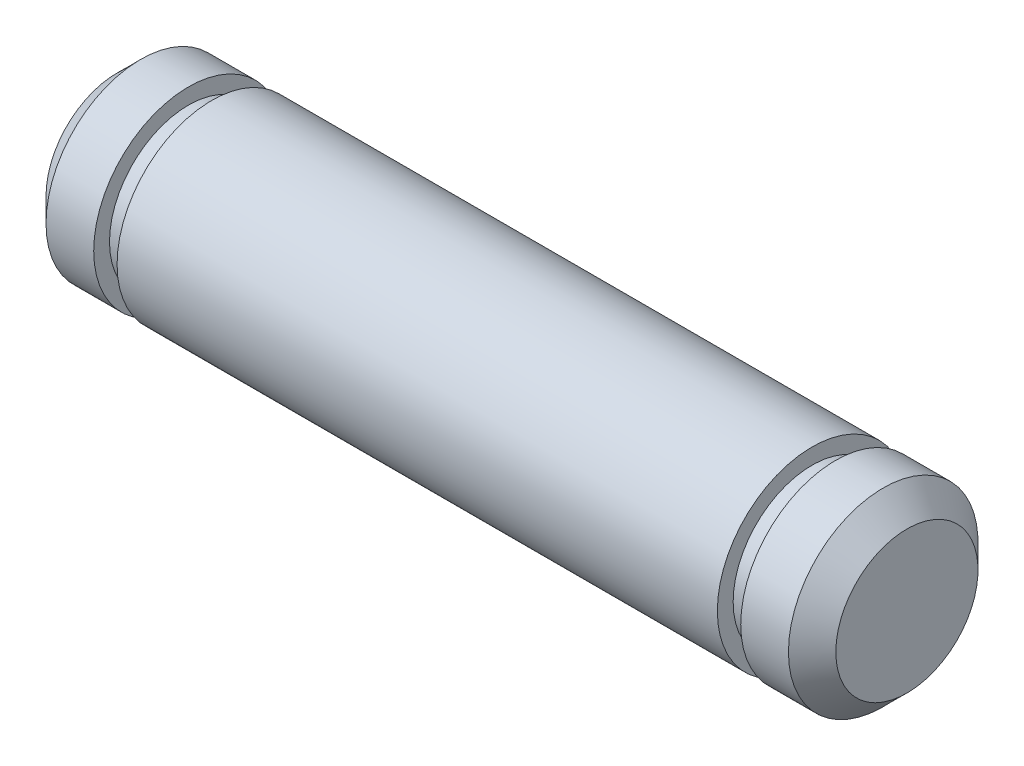
ISO-10303-21;
HEADER;
FILE_DESCRIPTION(('STEP AP214'),'2;1');
FILE_NAME('part.step','',(''),(''),'','','');
FILE_SCHEMA(('AUTOMOTIVE_DESIGN { 1 0 10303 214 1 1 1 1 }'));
ENDSEC;
DATA;
#1=APPLICATION_CONTEXT('core data for automotive mechanical design processes');
#2=APPLICATION_PROTOCOL_DEFINITION('international standard','automotive_design',2000,#1);
#3=PRODUCT_CONTEXT('',#1,'mechanical');
#4=PRODUCT('Part','Part','',(#3));
#5=PRODUCT_RELATED_PRODUCT_CATEGORY('part','',(#4));
#6=PRODUCT_DEFINITION_FORMATION('','',#4);
#7=PRODUCT_DEFINITION_CONTEXT('part definition',#1,'design');
#8=PRODUCT_DEFINITION('design','',#6,#7);
#9=PRODUCT_DEFINITION_SHAPE('','',#8);
#10=(LENGTH_UNIT() NAMED_UNIT(*) SI_UNIT(.MILLI.,.METRE.));
#11=(NAMED_UNIT(*) PLANE_ANGLE_UNIT() SI_UNIT($,.RADIAN.));
#12=(NAMED_UNIT(*) SI_UNIT($,.STERADIAN.) SOLID_ANGLE_UNIT());
#13=UNCERTAINTY_MEASURE_WITH_UNIT(LENGTH_MEASURE(1.E-05),#10,'distance_accuracy_value','');
#14=(GEOMETRIC_REPRESENTATION_CONTEXT(3) GLOBAL_UNCERTAINTY_ASSIGNED_CONTEXT((#13)) GLOBAL_UNIT_ASSIGNED_CONTEXT((#10,
#11,#12)) REPRESENTATION_CONTEXT('',''));
#15=CARTESIAN_POINT('',(0.,0.,0.));
#16=DIRECTION('',(0.,0.,1.));
#17=DIRECTION('',(1.,0.,0.));
#18=AXIS2_PLACEMENT_3D('',#15,#16,#17);
#19=CARTESIAN_POINT('',(12.5,0.,0.));
#20=DIRECTION('',(-1.,0.,0.));
#21=DIRECTION('',(0.,0.,1.));
#22=AXIS2_PLACEMENT_3D('',#19,#20,#21);
#23=CYLINDRICAL_SURFACE('',#22,3.);
#24=CARTESIAN_POINT('',(9.5,0.,0.));
#25=DIRECTION('',(-1.,0.,0.));
#26=DIRECTION('',(0.,0.,1.));
#27=AXIS2_PLACEMENT_3D('',#24,#25,#26);
#28=CIRCLE('',#27,3.);
#29=CARTESIAN_POINT('',(9.5,0.,3.));
#30=VERTEX_POINT('',#29);
#31=EDGE_CURVE('E60',#30,#30,#28,.T.);
#32=ORIENTED_EDGE('',*,*,#31,.T.);
#33=EDGE_LOOP('',(#32));
#34=FACE_BOUND('',#33,.T.);
#35=CARTESIAN_POINT('',(-9.5,0.,0.));
#36=DIRECTION('',(-1.,0.,0.));
#37=DIRECTION('',(0.,0.,1.));
#38=AXIS2_PLACEMENT_3D('',#35,#36,#37);
#39=CIRCLE('',#38,3.);
#40=CARTESIAN_POINT('',(-9.5,0.,3.));
#41=VERTEX_POINT('',#40);
#42=EDGE_CURVE('E69',#41,#41,#39,.T.);
#43=ORIENTED_EDGE('',*,*,#42,.F.);
#44=EDGE_LOOP('',(#43));
#45=FACE_BOUND('',#44,.T.);
#46=ADVANCED_FACE('F31',(#34,#45),#23,.T.);
#47=CARTESIAN_POINT('',(9.5,3.,0.));
#48=DIRECTION('',(1.,0.,0.));
#49=DIRECTION('',(0.,0.,-1.));
#50=AXIS2_PLACEMENT_3D('',#47,#48,#49);
#51=PLANE('',#50);
#52=CARTESIAN_POINT('',(9.5,0.,0.));
#53=DIRECTION('',(-1.,0.,0.));
#54=DIRECTION('',(0.,0.,1.));
#55=AXIS2_PLACEMENT_3D('',#52,#53,#54);
#56=CIRCLE('',#55,2.5);
#57=CARTESIAN_POINT('',(9.5,0.,2.5));
#58=VERTEX_POINT('',#57);
#59=EDGE_CURVE('E51',#58,#58,#56,.T.);
#60=ORIENTED_EDGE('',*,*,#59,.T.);
#61=EDGE_LOOP('',(#60));
#62=FACE_BOUND('',#61,.T.);
#63=ORIENTED_EDGE('',*,*,#31,.F.);
#64=EDGE_LOOP('',(#63));
#65=FACE_BOUND('',#64,.T.);
#66=ADVANCED_FACE('F94',(#62,#65),#51,.T.);
#67=CARTESIAN_POINT('',(12.5,0.,0.));
#68=DIRECTION('',(-1.,0.,0.));
#69=DIRECTION('',(0.,0.,1.));
#70=AXIS2_PLACEMENT_3D('',#67,#68,#69);
#71=CYLINDRICAL_SURFACE('',#70,2.5);
#72=CARTESIAN_POINT('',(10.24,0.,0.));
#73=DIRECTION('',(-1.,0.,0.));
#74=DIRECTION('',(0.,0.,1.));
#75=AXIS2_PLACEMENT_3D('',#72,#73,#74);
#76=CIRCLE('',#75,2.5);
#77=CARTESIAN_POINT('',(10.24,0.,2.5));
#78=VERTEX_POINT('',#77);
#79=EDGE_CURVE('E54',#78,#78,#76,.T.);
#80=ORIENTED_EDGE('',*,*,#79,.T.);
#81=EDGE_LOOP('',(#80));
#82=FACE_BOUND('',#81,.T.);
#83=ORIENTED_EDGE('',*,*,#59,.F.);
#84=EDGE_LOOP('',(#83));
#85=FACE_BOUND('',#84,.T.);
#86=ADVANCED_FACE('F99',(#82,#85),#71,.T.);
#87=CARTESIAN_POINT('',(10.24,2.5,0.));
#88=DIRECTION('',(-1.,0.,0.));
#89=DIRECTION('',(0.,0.,1.));
#90=AXIS2_PLACEMENT_3D('',#87,#88,#89);
#91=PLANE('',#90);
#92=CARTESIAN_POINT('',(10.24,0.,0.));
#93=DIRECTION('',(-1.,0.,0.));
#94=DIRECTION('',(0.,0.,1.));
#95=AXIS2_PLACEMENT_3D('',#92,#93,#94);
#96=CIRCLE('',#95,3.);
#97=CARTESIAN_POINT('',(10.24,0.,3.));
#98=VERTEX_POINT('',#97);
#99=EDGE_CURVE('E57',#98,#98,#96,.T.);
#100=ORIENTED_EDGE('',*,*,#99,.T.);
#101=EDGE_LOOP('',(#100));
#102=FACE_BOUND('',#101,.T.);
#103=ORIENTED_EDGE('',*,*,#79,.F.);
#104=EDGE_LOOP('',(#103));
#105=FACE_BOUND('',#104,.T.);
#106=ADVANCED_FACE('F157',(#102,#105),#91,.T.);
#107=CARTESIAN_POINT('',(12.5,3.,0.));
#108=DIRECTION('',(-1.,0.,0.));
#109=DIRECTION('',(0.,0.,1.));
#110=AXIS2_PLACEMENT_3D('',#107,#108,#109);
#111=PLANE('',#110);
#112=CARTESIAN_POINT('',(12.5,0.,0.));
#113=DIRECTION('',(-1.,0.,0.));
#114=DIRECTION('',(0.,0.,1.));
#115=AXIS2_PLACEMENT_3D('',#112,#113,#114);
#116=CIRCLE('',#115,2.25);
#117=CARTESIAN_POINT('',(12.5,0.,2.25));
#118=VERTEX_POINT('',#117);
#119=EDGE_CURVE('E10',#118,#118,#116,.T.);
#120=ORIENTED_EDGE('',*,*,#119,.F.);
#121=EDGE_LOOP('',(#120));
#122=FACE_BOUND('',#121,.T.);
#123=ADVANCED_FACE('F161',(#122),#111,.F.);
#124=CARTESIAN_POINT('',(11.75,0.,0.));
#125=DIRECTION('',(-1.,0.,0.));
#126=DIRECTION('',(0.,0.,1.));
#127=AXIS2_PLACEMENT_3D('',#124,#125,#126);
#128=CONICAL_SURFACE('',#127,3.,0.785398163397448);
#129=ORIENTED_EDGE('',*,*,#119,.T.);
#130=EDGE_LOOP('',(#129));
#131=FACE_BOUND('',#130,.T.);
#132=CARTESIAN_POINT('',(11.75,0.,0.));
#133=DIRECTION('',(-1.,0.,0.));
#134=DIRECTION('',(0.,0.,1.));
#135=AXIS2_PLACEMENT_3D('',#132,#133,#134);
#136=CIRCLE('',#135,3.);
#137=CARTESIAN_POINT('',(11.75,0.,3.));
#138=VERTEX_POINT('',#137);
#139=EDGE_CURVE('E38',#138,#138,#136,.T.);
#140=ORIENTED_EDGE('',*,*,#139,.F.);
#141=EDGE_LOOP('',(#140));
#142=FACE_BOUND('',#141,.T.);
#143=ADVANCED_FACE('F91',(#131,#142),#128,.T.);
#144=ORIENTED_EDGE('',*,*,#139,.T.);
#145=EDGE_LOOP('',(#144));
#146=FACE_BOUND('',#145,.T.);
#147=ORIENTED_EDGE('',*,*,#99,.F.);
#148=EDGE_LOOP('',(#147));
#149=FACE_BOUND('',#148,.T.);
#150=ADVANCED_FACE('F81',(#146,#149),#23,.T.);
#151=CARTESIAN_POINT('',(-10.24,3.,0.));
#152=DIRECTION('',(1.,0.,0.));
#153=DIRECTION('',(0.,0.,-1.));
#154=AXIS2_PLACEMENT_3D('',#151,#152,#153);
#155=PLANE('',#154);
#156=CARTESIAN_POINT('',(-10.24,0.,0.));
#157=DIRECTION('',(-1.,0.,0.));
#158=DIRECTION('',(0.,0.,1.));
#159=AXIS2_PLACEMENT_3D('',#156,#157,#158);
#160=CIRCLE('',#159,2.5);
#161=CARTESIAN_POINT('',(-10.24,0.,2.5));
#162=VERTEX_POINT('',#161);
#163=EDGE_CURVE('E63',#162,#162,#160,.T.);
#164=ORIENTED_EDGE('',*,*,#163,.T.);
#165=EDGE_LOOP('',(#164));
#166=FACE_BOUND('',#165,.T.);
#167=CARTESIAN_POINT('',(-10.24,0.,0.));
#168=DIRECTION('',(-1.,0.,0.));
#169=DIRECTION('',(0.,0.,1.));
#170=AXIS2_PLACEMENT_3D('',#167,#168,#169);
#171=CIRCLE('',#170,3.);
#172=CARTESIAN_POINT('',(-10.24,0.,3.));
#173=VERTEX_POINT('',#172);
#174=EDGE_CURVE('E72',#173,#173,#171,.T.);
#175=ORIENTED_EDGE('',*,*,#174,.F.);
#176=EDGE_LOOP('',(#175));
#177=FACE_BOUND('',#176,.T.);
#178=ADVANCED_FACE('F78',(#166,#177),#155,.T.);
#179=CARTESIAN_POINT('',(12.5,0.,0.));
#180=DIRECTION('',(-1.,0.,0.));
#181=DIRECTION('',(0.,0.,1.));
#182=AXIS2_PLACEMENT_3D('',#179,#180,#181);
#183=CYLINDRICAL_SURFACE('',#182,2.5);
#184=CARTESIAN_POINT('',(-9.5,0.,0.));
#185=DIRECTION('',(-1.,0.,0.));
#186=DIRECTION('',(0.,0.,1.));
#187=AXIS2_PLACEMENT_3D('',#184,#185,#186);
#188=CIRCLE('',#187,2.5);
#189=CARTESIAN_POINT('',(-9.5,0.,2.5));
#190=VERTEX_POINT('',#189);
#191=EDGE_CURVE('E66',#190,#190,#188,.T.);
#192=ORIENTED_EDGE('',*,*,#191,.T.);
#193=EDGE_LOOP('',(#192));
#194=FACE_BOUND('',#193,.T.);
#195=ORIENTED_EDGE('',*,*,#163,.F.);
#196=EDGE_LOOP('',(#195));
#197=FACE_BOUND('',#196,.T.);
#198=ADVANCED_FACE('F80',(#194,#197),#183,.T.);
#199=CARTESIAN_POINT('',(-9.5,2.5,0.));
#200=DIRECTION('',(-1.,0.,0.));
#201=DIRECTION('',(0.,0.,1.));
#202=AXIS2_PLACEMENT_3D('',#199,#200,#201);
#203=PLANE('',#202);
#204=ORIENTED_EDGE('',*,*,#42,.T.);
#205=EDGE_LOOP('',(#204));
#206=FACE_BOUND('',#205,.T.);
#207=ORIENTED_EDGE('',*,*,#191,.F.);
#208=EDGE_LOOP('',(#207));
#209=FACE_BOUND('',#208,.T.);
#210=ADVANCED_FACE('F88',(#206,#209),#203,.T.);
#211=CARTESIAN_POINT('',(-12.5,0.,0.));
#212=DIRECTION('',(1.,0.,0.));
#213=DIRECTION('',(0.,0.,-1.));
#214=AXIS2_PLACEMENT_3D('',#211,#212,#213);
#215=PLANE('',#214);
#216=CARTESIAN_POINT('',(-12.5,0.,0.));
#217=DIRECTION('',(-1.,0.,0.));
#218=DIRECTION('',(0.,0.,1.));
#219=AXIS2_PLACEMENT_3D('',#216,#217,#218);
#220=CIRCLE('',#219,2.25);
#221=CARTESIAN_POINT('',(-12.5,0.,2.25));
#222=VERTEX_POINT('',#221);
#223=EDGE_CURVE('E46',#222,#222,#220,.T.);
#224=ORIENTED_EDGE('',*,*,#223,.T.);
#225=EDGE_LOOP('',(#224));
#226=FACE_BOUND('',#225,.T.);
#227=ADVANCED_FACE('F33',(#226),#215,.F.);
#228=CARTESIAN_POINT('',(-12.5,0.,0.));
#229=DIRECTION('',(1.,0.,0.));
#230=DIRECTION('',(0.,0.,-1.));
#231=AXIS2_PLACEMENT_3D('',#228,#229,#230);
#232=CONICAL_SURFACE('',#231,2.25,0.785398163397448);
#233=CARTESIAN_POINT('',(-11.75,0.,0.));
#234=DIRECTION('',(-1.,0.,0.));
#235=DIRECTION('',(0.,0.,1.));
#236=AXIS2_PLACEMENT_3D('',#233,#234,#235);
#237=CIRCLE('',#236,3.);
#238=CARTESIAN_POINT('',(-11.75,0.,3.));
#239=VERTEX_POINT('',#238);
#240=EDGE_CURVE('E42',#239,#239,#237,.T.);
#241=ORIENTED_EDGE('',*,*,#240,.T.);
#242=EDGE_LOOP('',(#241));
#243=FACE_BOUND('',#242,.T.);
#244=ORIENTED_EDGE('',*,*,#223,.F.);
#245=EDGE_LOOP('',(#244));
#246=FACE_BOUND('',#245,.T.);
#247=ADVANCED_FACE('F105',(#243,#246),#232,.T.);
#248=ORIENTED_EDGE('',*,*,#240,.F.);
#249=EDGE_LOOP('',(#248));
#250=FACE_BOUND('',#249,.T.);
#251=ORIENTED_EDGE('',*,*,#174,.T.);
#252=EDGE_LOOP('',(#251));
#253=FACE_BOUND('',#252,.T.);
#254=ADVANCED_FACE('F76',(#250,#253),#23,.T.);
#255=CLOSED_SHELL('',(#46,#66,#86,#106,#123,#143,#150,#178,#198,#210,#227,#247,#254));
#256=MANIFOLD_SOLID_BREP('B2',#255);
#257=ADVANCED_BREP_SHAPE_REPRESENTATION('',(#18,#256),#14);
#258=SHAPE_DEFINITION_REPRESENTATION(#9,#257);
ENDSEC;
END-ISO-10303-21;
